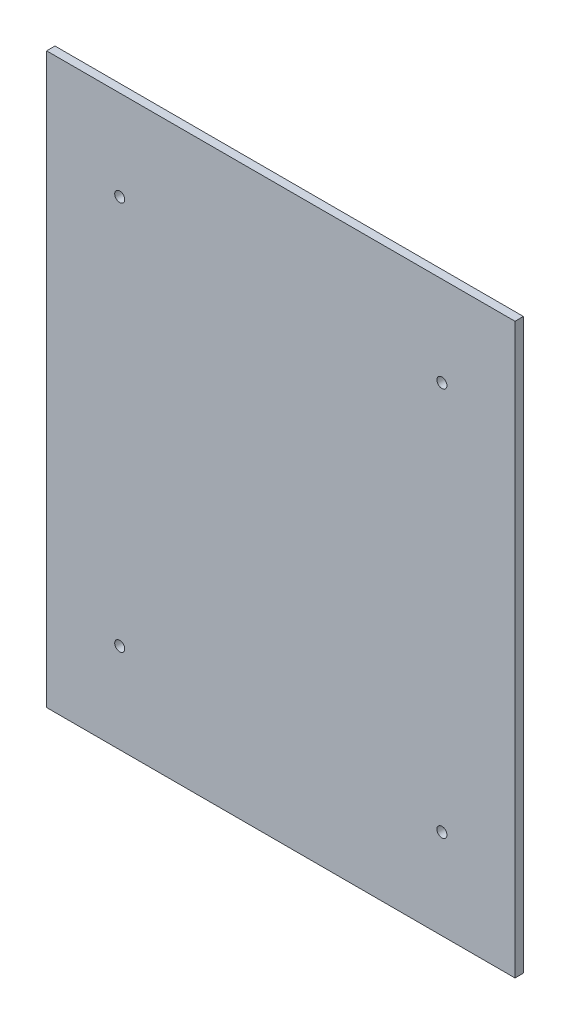
ISO-10303-21;
HEADER;
FILE_DESCRIPTION(('STEP AP214'),'2;1');
FILE_NAME('part.step','',(''),(''),'','','');
FILE_SCHEMA(('AUTOMOTIVE_DESIGN { 1 0 10303 214 1 1 1 1 }'));
ENDSEC;
DATA;
#1=APPLICATION_CONTEXT('core data for automotive mechanical design processes');
#2=APPLICATION_PROTOCOL_DEFINITION('international standard','automotive_design',2000,#1);
#3=PRODUCT_CONTEXT('',#1,'mechanical');
#4=PRODUCT('Part','Part','',(#3));
#5=PRODUCT_RELATED_PRODUCT_CATEGORY('part','',(#4));
#6=PRODUCT_DEFINITION_FORMATION('','',#4);
#7=PRODUCT_DEFINITION_CONTEXT('part definition',#1,'design');
#8=PRODUCT_DEFINITION('design','',#6,#7);
#9=PRODUCT_DEFINITION_SHAPE('','',#8);
#10=(LENGTH_UNIT() NAMED_UNIT(*) SI_UNIT(.MILLI.,.METRE.));
#11=(NAMED_UNIT(*) PLANE_ANGLE_UNIT() SI_UNIT($,.RADIAN.));
#12=(NAMED_UNIT(*) SI_UNIT($,.STERADIAN.) SOLID_ANGLE_UNIT());
#13=UNCERTAINTY_MEASURE_WITH_UNIT(LENGTH_MEASURE(1.E-05),#10,'distance_accuracy_value','');
#14=(GEOMETRIC_REPRESENTATION_CONTEXT(3) GLOBAL_UNCERTAINTY_ASSIGNED_CONTEXT((#13)) GLOBAL_UNIT_ASSIGNED_CONTEXT((#10,
#11,#12)) REPRESENTATION_CONTEXT('',''));
#15=CARTESIAN_POINT('',(0.,0.,0.));
#16=DIRECTION('',(0.,0.,1.));
#17=DIRECTION('',(1.,0.,0.));
#18=AXIS2_PLACEMENT_3D('',#15,#16,#17);
#19=CARTESIAN_POINT('',(5854.7,0.,6.35));
#20=DIRECTION('',(0.,1.,0.));
#21=DIRECTION('',(0.,0.,1.));
#22=AXIS2_PLACEMENT_3D('',#19,#20,#21);
#23=PLANE('',#22);
#24=DIRECTION('',(1.,0.,0.));
#25=VECTOR('',#24,1.);
#26=CARTESIAN_POINT('',(5854.7,0.,0.));
#27=LINE('',#26,#25);
#28=CARTESIAN_POINT('',(5676.9,0.,0.));
#29=VERTEX_POINT('',#28);
#30=CARTESIAN_POINT('',(6032.5,0.,0.));
#31=VERTEX_POINT('',#30);
#32=EDGE_CURVE('E104',#29,#31,#27,.T.);
#33=ORIENTED_EDGE('',*,*,#32,.F.);
#34=DIRECTION('',(0.,0.,-1.));
#35=VECTOR('',#34,1.);
#36=CARTESIAN_POINT('',(5676.9,0.,6.35));
#37=LINE('',#36,#35);
#38=CARTESIAN_POINT('',(5676.9,0.,6.35));
#39=VERTEX_POINT('',#38);
#40=EDGE_CURVE('E11',#39,#29,#37,.T.);
#41=ORIENTED_EDGE('',*,*,#40,.F.);
#42=DIRECTION('',(1.,0.,0.));
#43=VECTOR('',#42,1.);
#44=CARTESIAN_POINT('',(5854.7,0.,6.35));
#45=LINE('',#44,#43);
#46=CARTESIAN_POINT('',(6032.5,0.,6.35));
#47=VERTEX_POINT('',#46);
#48=EDGE_CURVE('E81',#39,#47,#45,.T.);
#49=ORIENTED_EDGE('',*,*,#48,.T.);
#50=DIRECTION('',(0.,0.,-1.));
#51=VECTOR('',#50,1.);
#52=CARTESIAN_POINT('',(6032.5,0.,6.35));
#53=LINE('',#52,#51);
#54=EDGE_CURVE('E40',#47,#31,#53,.T.);
#55=ORIENTED_EDGE('',*,*,#54,.T.);
#56=EDGE_LOOP('',(#33,#41,#49,#55));
#57=FACE_BOUND('',#56,.T.);
#58=ADVANCED_FACE('F16',(#57),#23,.T.);
#59=CARTESIAN_POINT('',(5676.9,-215.9,6.35));
#60=DIRECTION('',(1.,0.,0.));
#61=DIRECTION('',(0.,0.,-1.));
#62=AXIS2_PLACEMENT_3D('',#59,#60,#61);
#63=PLANE('',#62);
#64=DIRECTION('',(0.,-1.,0.));
#65=VECTOR('',#64,1.);
#66=CARTESIAN_POINT('',(5676.9,-215.9,0.));
#67=LINE('',#66,#65);
#68=CARTESIAN_POINT('',(5676.9,-431.8,0.));
#69=VERTEX_POINT('',#68);
#70=EDGE_CURVE('E88',#29,#69,#67,.T.);
#71=ORIENTED_EDGE('',*,*,#70,.T.);
#72=DIRECTION('',(0.,0.,-1.));
#73=VECTOR('',#72,1.);
#74=CARTESIAN_POINT('',(5676.9,-431.8,6.35));
#75=LINE('',#74,#73);
#76=CARTESIAN_POINT('',(5676.9,-431.8,6.35));
#77=VERTEX_POINT('',#76);
#78=EDGE_CURVE('E26',#77,#69,#75,.T.);
#79=ORIENTED_EDGE('',*,*,#78,.F.);
#80=DIRECTION('',(0.,-1.,0.));
#81=VECTOR('',#80,1.);
#82=CARTESIAN_POINT('',(5676.9,-215.9,6.35));
#83=LINE('',#82,#81);
#84=EDGE_CURVE('E75',#39,#77,#83,.T.);
#85=ORIENTED_EDGE('',*,*,#84,.F.);
#86=ORIENTED_EDGE('',*,*,#40,.T.);
#87=EDGE_LOOP('',(#71,#79,#85,#86));
#88=FACE_BOUND('',#87,.T.);
#89=ADVANCED_FACE('F86',(#88),#63,.F.);
#90=CARTESIAN_POINT('',(5854.7,-431.8,6.35));
#91=DIRECTION('',(0.,1.,0.));
#92=DIRECTION('',(0.,0.,1.));
#93=AXIS2_PLACEMENT_3D('',#90,#91,#92);
#94=PLANE('',#93);
#95=DIRECTION('',(1.,0.,0.));
#96=VECTOR('',#95,1.);
#97=CARTESIAN_POINT('',(5854.7,-431.8,0.));
#98=LINE('',#97,#96);
#99=CARTESIAN_POINT('',(6032.5,-431.8,0.));
#100=VERTEX_POINT('',#99);
#101=EDGE_CURVE('E110',#69,#100,#98,.T.);
#102=ORIENTED_EDGE('',*,*,#101,.T.);
#103=DIRECTION('',(0.,0.,-1.));
#104=VECTOR('',#103,1.);
#105=CARTESIAN_POINT('',(6032.5,-431.8,6.35));
#106=LINE('',#105,#104);
#107=CARTESIAN_POINT('',(6032.5,-431.8,6.35));
#108=VERTEX_POINT('',#107);
#109=EDGE_CURVE('E59',#108,#100,#106,.T.);
#110=ORIENTED_EDGE('',*,*,#109,.F.);
#111=DIRECTION('',(1.,0.,0.));
#112=VECTOR('',#111,1.);
#113=CARTESIAN_POINT('',(5854.7,-431.8,6.35));
#114=LINE('',#113,#112);
#115=EDGE_CURVE('E80',#77,#108,#114,.T.);
#116=ORIENTED_EDGE('',*,*,#115,.F.);
#117=ORIENTED_EDGE('',*,*,#78,.T.);
#118=EDGE_LOOP('',(#102,#110,#116,#117));
#119=FACE_BOUND('',#118,.T.);
#120=ADVANCED_FACE('F93',(#119),#94,.F.);
#121=CARTESIAN_POINT('',(6032.5,-215.9,6.35));
#122=DIRECTION('',(1.,0.,0.));
#123=DIRECTION('',(0.,0.,-1.));
#124=AXIS2_PLACEMENT_3D('',#121,#122,#123);
#125=PLANE('',#124);
#126=DIRECTION('',(0.,-1.,0.));
#127=VECTOR('',#126,1.);
#128=CARTESIAN_POINT('',(6032.5,-215.9,0.));
#129=LINE('',#128,#127);
#130=EDGE_CURVE('E113',#31,#100,#129,.T.);
#131=ORIENTED_EDGE('',*,*,#130,.F.);
#132=ORIENTED_EDGE('',*,*,#54,.F.);
#133=DIRECTION('',(0.,-1.,0.));
#134=VECTOR('',#133,1.);
#135=CARTESIAN_POINT('',(6032.5,-215.9,6.35));
#136=LINE('',#135,#134);
#137=EDGE_CURVE('E95',#47,#108,#136,.T.);
#138=ORIENTED_EDGE('',*,*,#137,.T.);
#139=ORIENTED_EDGE('',*,*,#109,.T.);
#140=EDGE_LOOP('',(#131,#132,#138,#139));
#141=FACE_BOUND('',#140,.T.);
#142=ADVANCED_FACE('F153',(#141),#125,.T.);
#143=CARTESIAN_POINT('',(5854.7,-215.9,6.35));
#144=DIRECTION('',(0.,0.,1.));
#145=DIRECTION('',(1.,0.,0.));
#146=AXIS2_PLACEMENT_3D('',#143,#144,#145);
#147=PLANE('',#146);
#148=CARTESIAN_POINT('',(5977.001,-363.601,6.35));
#149=DIRECTION('',(0.,0.,1.));
#150=DIRECTION('',(1.,0.,0.));
#151=AXIS2_PLACEMENT_3D('',#148,#149,#150);
#152=CIRCLE('',#151,3.81);
#153=CARTESIAN_POINT('',(5980.811,-363.601,6.35));
#154=VERTEX_POINT('',#153);
#155=EDGE_CURVE('E19',#154,#154,#152,.F.);
#156=ORIENTED_EDGE('',*,*,#155,.T.);
#157=EDGE_LOOP('',(#156));
#158=FACE_BOUND('',#157,.T.);
#159=CARTESIAN_POINT('',(5732.399,-363.601,6.35));
#160=DIRECTION('',(0.,0.,1.));
#161=DIRECTION('',(1.,0.,0.));
#162=AXIS2_PLACEMENT_3D('',#159,#160,#161);
#163=CIRCLE('',#162,3.81);
#164=CARTESIAN_POINT('',(5736.209,-363.601,6.35));
#165=VERTEX_POINT('',#164);
#166=EDGE_CURVE('E128',#165,#165,#163,.F.);
#167=ORIENTED_EDGE('',*,*,#166,.T.);
#168=EDGE_LOOP('',(#167));
#169=FACE_BOUND('',#168,.T.);
#170=CARTESIAN_POINT('',(5732.399,-68.199,6.35));
#171=DIRECTION('',(0.,0.,1.));
#172=DIRECTION('',(1.,0.,0.));
#173=AXIS2_PLACEMENT_3D('',#170,#171,#172);
#174=CIRCLE('',#173,3.81);
#175=CARTESIAN_POINT('',(5736.209,-68.199,6.35));
#176=VERTEX_POINT('',#175);
#177=EDGE_CURVE('E124',#176,#176,#174,.F.);
#178=ORIENTED_EDGE('',*,*,#177,.T.);
#179=EDGE_LOOP('',(#178));
#180=FACE_BOUND('',#179,.T.);
#181=CARTESIAN_POINT('',(5977.001,-68.199,6.35));
#182=DIRECTION('',(0.,0.,1.));
#183=DIRECTION('',(1.,0.,0.));
#184=AXIS2_PLACEMENT_3D('',#181,#182,#183);
#185=CIRCLE('',#184,3.81);
#186=CARTESIAN_POINT('',(5980.811,-68.199,6.35));
#187=VERTEX_POINT('',#186);
#188=EDGE_CURVE('E107',#187,#187,#185,.F.);
#189=ORIENTED_EDGE('',*,*,#188,.T.);
#190=EDGE_LOOP('',(#189));
#191=FACE_BOUND('',#190,.T.);
#192=ORIENTED_EDGE('',*,*,#48,.F.);
#193=ORIENTED_EDGE('',*,*,#84,.T.);
#194=ORIENTED_EDGE('',*,*,#115,.T.);
#195=ORIENTED_EDGE('',*,*,#137,.F.);
#196=EDGE_LOOP('',(#192,#193,#194,#195));
#197=FACE_BOUND('',#196,.T.);
#198=ADVANCED_FACE('F77',(#158,#169,#180,#191,#197),#147,.T.);
#199=CARTESIAN_POINT('',(5854.7,-215.9,0.));
#200=DIRECTION('',(0.,0.,1.));
#201=DIRECTION('',(1.,0.,0.));
#202=AXIS2_PLACEMENT_3D('',#199,#200,#201);
#203=PLANE('',#202);
#204=CARTESIAN_POINT('',(5977.001,-363.601,0.));
#205=DIRECTION('',(0.,0.,-1.));
#206=DIRECTION('',(-1.,0.,0.));
#207=AXIS2_PLACEMENT_3D('',#204,#205,#206);
#208=CIRCLE('',#207,3.81);
#209=CARTESIAN_POINT('',(5973.191,-363.601,0.));
#210=VERTEX_POINT('',#209);
#211=EDGE_CURVE('E147',#210,#210,#208,.T.);
#212=ORIENTED_EDGE('',*,*,#211,.F.);
#213=EDGE_LOOP('',(#212));
#214=FACE_BOUND('',#213,.T.);
#215=CARTESIAN_POINT('',(5732.399,-363.601,0.));
#216=DIRECTION('',(0.,0.,-1.));
#217=DIRECTION('',(-1.,0.,0.));
#218=AXIS2_PLACEMENT_3D('',#215,#216,#217);
#219=CIRCLE('',#218,3.81);
#220=CARTESIAN_POINT('',(5728.589,-363.601,0.));
#221=VERTEX_POINT('',#220);
#222=EDGE_CURVE('E131',#221,#221,#219,.T.);
#223=ORIENTED_EDGE('',*,*,#222,.F.);
#224=EDGE_LOOP('',(#223));
#225=FACE_BOUND('',#224,.T.);
#226=CARTESIAN_POINT('',(5732.399,-68.199,0.));
#227=DIRECTION('',(0.,0.,-1.));
#228=DIRECTION('',(-1.,0.,0.));
#229=AXIS2_PLACEMENT_3D('',#226,#227,#228);
#230=CIRCLE('',#229,3.81);
#231=CARTESIAN_POINT('',(5728.589,-68.199,0.));
#232=VERTEX_POINT('',#231);
#233=EDGE_CURVE('E127',#232,#232,#230,.T.);
#234=ORIENTED_EDGE('',*,*,#233,.F.);
#235=EDGE_LOOP('',(#234));
#236=FACE_BOUND('',#235,.T.);
#237=CARTESIAN_POINT('',(5977.001,-68.199,0.));
#238=DIRECTION('',(0.,0.,-1.));
#239=DIRECTION('',(-1.,0.,0.));
#240=AXIS2_PLACEMENT_3D('',#237,#238,#239);
#241=CIRCLE('',#240,3.81);
#242=CARTESIAN_POINT('',(5973.191,-68.199,0.));
#243=VERTEX_POINT('',#242);
#244=EDGE_CURVE('E123',#243,#243,#241,.T.);
#245=ORIENTED_EDGE('',*,*,#244,.F.);
#246=EDGE_LOOP('',(#245));
#247=FACE_BOUND('',#246,.T.);
#248=ORIENTED_EDGE('',*,*,#32,.T.);
#249=ORIENTED_EDGE('',*,*,#130,.T.);
#250=ORIENTED_EDGE('',*,*,#101,.F.);
#251=ORIENTED_EDGE('',*,*,#70,.F.);
#252=EDGE_LOOP('',(#248,#249,#250,#251));
#253=FACE_BOUND('',#252,.T.);
#254=ADVANCED_FACE('F160',(#214,#225,#236,#247,#253),#203,.F.);
#255=CARTESIAN_POINT('',(5977.001,-68.199,560.557655505868));
#256=DIRECTION('',(0.,0.,-1.));
#257=DIRECTION('',(-1.,0.,0.));
#258=AXIS2_PLACEMENT_3D('',#255,#256,#257);
#259=CYLINDRICAL_SURFACE('',#258,3.81);
#260=ORIENTED_EDGE('',*,*,#188,.F.);
#261=EDGE_LOOP('',(#260));
#262=FACE_BOUND('',#261,.T.);
#263=ORIENTED_EDGE('',*,*,#244,.T.);
#264=EDGE_LOOP('',(#263));
#265=FACE_BOUND('',#264,.T.);
#266=ADVANCED_FACE('F177',(#262,#265),#259,.F.);
#267=CARTESIAN_POINT('',(5732.399,-68.199,560.557655505868));
#268=DIRECTION('',(0.,0.,-1.));
#269=DIRECTION('',(-1.,0.,0.));
#270=AXIS2_PLACEMENT_3D('',#267,#268,#269);
#271=CYLINDRICAL_SURFACE('',#270,3.81);
#272=ORIENTED_EDGE('',*,*,#177,.F.);
#273=EDGE_LOOP('',(#272));
#274=FACE_BOUND('',#273,.T.);
#275=ORIENTED_EDGE('',*,*,#233,.T.);
#276=EDGE_LOOP('',(#275));
#277=FACE_BOUND('',#276,.T.);
#278=ADVANCED_FACE('F191',(#274,#277),#271,.F.);
#279=CARTESIAN_POINT('',(5732.399,-363.601,560.557655505868));
#280=DIRECTION('',(0.,0.,-1.));
#281=DIRECTION('',(-1.,0.,0.));
#282=AXIS2_PLACEMENT_3D('',#279,#280,#281);
#283=CYLINDRICAL_SURFACE('',#282,3.81);
#284=ORIENTED_EDGE('',*,*,#166,.F.);
#285=EDGE_LOOP('',(#284));
#286=FACE_BOUND('',#285,.T.);
#287=ORIENTED_EDGE('',*,*,#222,.T.);
#288=EDGE_LOOP('',(#287));
#289=FACE_BOUND('',#288,.T.);
#290=ADVANCED_FACE('F199',(#286,#289),#283,.F.);
#291=CARTESIAN_POINT('',(5977.001,-363.601,560.557655505868));
#292=DIRECTION('',(0.,0.,-1.));
#293=DIRECTION('',(-1.,0.,0.));
#294=AXIS2_PLACEMENT_3D('',#291,#292,#293);
#295=CYLINDRICAL_SURFACE('',#294,3.81);
#296=ORIENTED_EDGE('',*,*,#155,.F.);
#297=EDGE_LOOP('',(#296));
#298=FACE_BOUND('',#297,.T.);
#299=ORIENTED_EDGE('',*,*,#211,.T.);
#300=EDGE_LOOP('',(#299));
#301=FACE_BOUND('',#300,.T.);
#302=ADVANCED_FACE('F207',(#298,#301),#295,.F.);
#303=CLOSED_SHELL('',(#58,#89,#120,#142,#198,#254,#266,#278,#290,#302));
#304=MANIFOLD_SOLID_BREP('B1',#303);
#305=ADVANCED_BREP_SHAPE_REPRESENTATION('',(#18,#304),#14);
#306=SHAPE_DEFINITION_REPRESENTATION(#9,#305);
ENDSEC;
END-ISO-10303-21;
